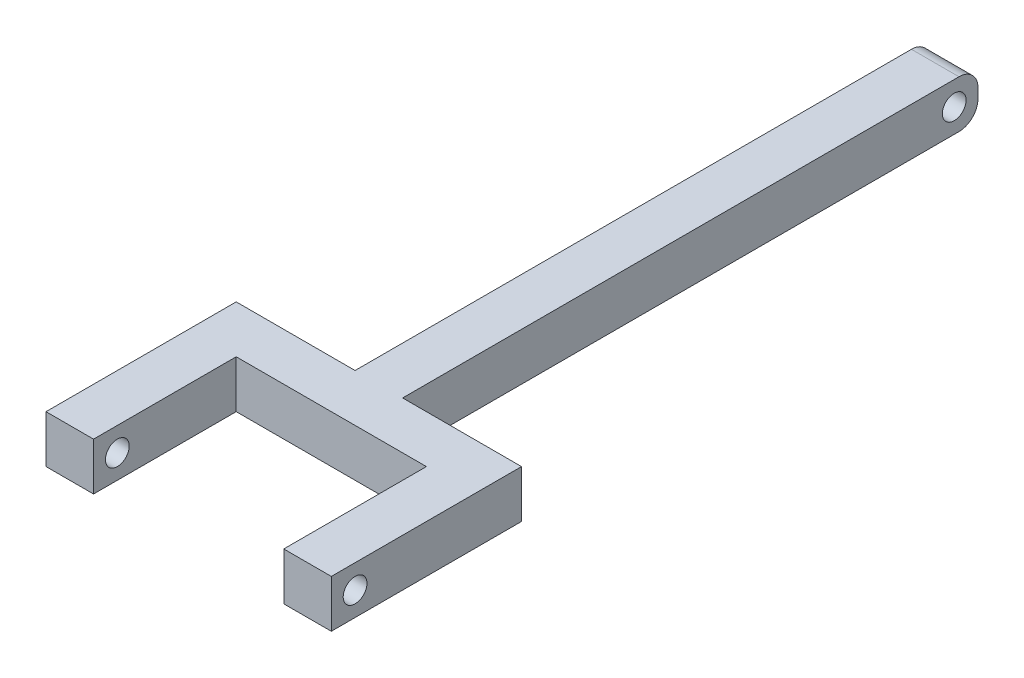
ISO-10303-21;
HEADER;
FILE_DESCRIPTION(('STEP AP214'),'2;1');
FILE_NAME('part.step','',(''),(''),'','','');
FILE_SCHEMA(('AUTOMOTIVE_DESIGN { 1 0 10303 214 1 1 1 1 }'));
ENDSEC;
DATA;
#1=APPLICATION_CONTEXT('core data for automotive mechanical design processes');
#2=APPLICATION_PROTOCOL_DEFINITION('international standard','automotive_design',2000,#1);
#3=PRODUCT_CONTEXT('',#1,'mechanical');
#4=PRODUCT('Part','Part','',(#3));
#5=PRODUCT_RELATED_PRODUCT_CATEGORY('part','',(#4));
#6=PRODUCT_DEFINITION_FORMATION('','',#4);
#7=PRODUCT_DEFINITION_CONTEXT('part definition',#1,'design');
#8=PRODUCT_DEFINITION('design','',#6,#7);
#9=PRODUCT_DEFINITION_SHAPE('','',#8);
#10=(LENGTH_UNIT() NAMED_UNIT(*) SI_UNIT(.MILLI.,.METRE.));
#11=(NAMED_UNIT(*) PLANE_ANGLE_UNIT() SI_UNIT($,.RADIAN.));
#12=(NAMED_UNIT(*) SI_UNIT($,.STERADIAN.) SOLID_ANGLE_UNIT());
#13=UNCERTAINTY_MEASURE_WITH_UNIT(LENGTH_MEASURE(1.E-05),#10,'distance_accuracy_value','');
#14=(GEOMETRIC_REPRESENTATION_CONTEXT(3) GLOBAL_UNCERTAINTY_ASSIGNED_CONTEXT((#13)) GLOBAL_UNIT_ASSIGNED_CONTEXT((#10,
#11,#12)) REPRESENTATION_CONTEXT('',''));
#15=CARTESIAN_POINT('',(0.,0.,0.));
#16=DIRECTION('',(0.,0.,1.));
#17=DIRECTION('',(1.,0.,0.));
#18=AXIS2_PLACEMENT_3D('',#15,#16,#17);
#19=CARTESIAN_POINT('',(-38.1,0.,0.));
#20=DIRECTION('',(1.,0.,0.));
#21=DIRECTION('',(0.,0.,-1.));
#22=AXIS2_PLACEMENT_3D('',#19,#20,#21);
#23=PLANE('',#22);
#24=DIRECTION('',(0.,0.,1.));
#25=VECTOR('',#24,1.);
#26=CARTESIAN_POINT('',(-38.1,6.35,73.66));
#27=LINE('',#26,#25);
#28=CARTESIAN_POINT('',(-38.1,6.35,73.66));
#29=VERTEX_POINT('',#28);
#30=CARTESIAN_POINT('',(-38.1,6.35,124.46));
#31=VERTEX_POINT('',#30);
#32=EDGE_CURVE('E136',#29,#31,#27,.T.);
#33=ORIENTED_EDGE('',*,*,#32,.F.);
#34=DIRECTION('',(0.,1.,0.));
#35=VECTOR('',#34,1.);
#36=CARTESIAN_POINT('',(-38.1,-6.35,73.66));
#37=LINE('',#36,#35);
#38=CARTESIAN_POINT('',(-38.1,-6.35,73.66));
#39=VERTEX_POINT('',#38);
#40=EDGE_CURVE('E209',#39,#29,#37,.T.);
#41=ORIENTED_EDGE('',*,*,#40,.F.);
#42=DIRECTION('',(0.,0.,-1.));
#43=VECTOR('',#42,1.);
#44=CARTESIAN_POINT('',(-38.1,-6.35,86.36));
#45=LINE('',#44,#43);
#46=CARTESIAN_POINT('',(-38.1,-6.35,124.46));
#47=VERTEX_POINT('',#46);
#48=EDGE_CURVE('E149',#47,#39,#45,.T.);
#49=ORIENTED_EDGE('',*,*,#48,.F.);
#50=DIRECTION('',(0.,-1.,0.));
#51=VECTOR('',#50,1.);
#52=CARTESIAN_POINT('',(-38.1,-6.35,124.46));
#53=LINE('',#52,#51);
#54=EDGE_CURVE('E155',#31,#47,#53,.T.);
#55=ORIENTED_EDGE('',*,*,#54,.F.);
#56=EDGE_LOOP('',(#33,#41,#49,#55));
#57=FACE_BOUND('',#56,.T.);
#58=CARTESIAN_POINT('',(-38.1,0.,118.11));
#59=DIRECTION('',(1.,0.,0.));
#60=DIRECTION('',(0.,0.,-1.));
#61=AXIS2_PLACEMENT_3D('',#58,#59,#60);
#62=CIRCLE('',#61,3.175);
#63=CARTESIAN_POINT('',(-38.1,0.,114.935));
#64=VERTEX_POINT('',#63);
#65=EDGE_CURVE('E163',#64,#64,#62,.F.);
#66=ORIENTED_EDGE('',*,*,#65,.F.);
#67=EDGE_LOOP('',(#66));
#68=FACE_BOUND('',#67,.T.);
#69=ADVANCED_FACE('F33',(#57,#68),#23,.F.);
#70=CARTESIAN_POINT('',(-25.4,-6.35,124.46));
#71=DIRECTION('',(-1.,0.,0.));
#72=DIRECTION('',(0.,0.,1.));
#73=AXIS2_PLACEMENT_3D('',#70,#71,#72);
#74=PLANE('',#73);
#75=DIRECTION('',(0.,0.,-1.));
#76=VECTOR('',#75,1.);
#77=CARTESIAN_POINT('',(-25.4,-6.35,124.46));
#78=LINE('',#77,#76);
#79=CARTESIAN_POINT('',(-25.4,-6.35,124.46));
#80=VERTEX_POINT('',#79);
#81=CARTESIAN_POINT('',(-25.4,-6.35,86.36));
#82=VERTEX_POINT('',#81);
#83=EDGE_CURVE('E174',#80,#82,#78,.T.);
#84=ORIENTED_EDGE('',*,*,#83,.T.);
#85=DIRECTION('',(0.,1.,0.));
#86=VECTOR('',#85,1.);
#87=CARTESIAN_POINT('',(-25.4,0.,86.36));
#88=LINE('',#87,#86);
#89=CARTESIAN_POINT('',(-25.4,6.35,86.36));
#90=VERTEX_POINT('',#89);
#91=EDGE_CURVE('E177',#82,#90,#88,.T.);
#92=ORIENTED_EDGE('',*,*,#91,.T.);
#93=DIRECTION('',(0.,0.,-1.));
#94=VECTOR('',#93,1.);
#95=CARTESIAN_POINT('',(-25.4,6.35,124.46));
#96=LINE('',#95,#94);
#97=CARTESIAN_POINT('',(-25.4,6.35,124.46));
#98=VERTEX_POINT('',#97);
#99=EDGE_CURVE('E173',#98,#90,#96,.T.);
#100=ORIENTED_EDGE('',*,*,#99,.F.);
#101=DIRECTION('',(0.,1.,0.));
#102=VECTOR('',#101,1.);
#103=CARTESIAN_POINT('',(-25.4,-6.35,124.46));
#104=LINE('',#103,#102);
#105=EDGE_CURVE('E157',#80,#98,#104,.T.);
#106=ORIENTED_EDGE('',*,*,#105,.F.);
#107=EDGE_LOOP('',(#84,#92,#100,#106));
#108=FACE_BOUND('',#107,.T.);
#109=CARTESIAN_POINT('',(-25.4,0.,118.11));
#110=DIRECTION('',(-1.,0.,0.));
#111=DIRECTION('',(0.,0.,1.));
#112=AXIS2_PLACEMENT_3D('',#109,#110,#111);
#113=CIRCLE('',#112,3.175);
#114=CARTESIAN_POINT('',(-25.4,0.,121.285));
#115=VERTEX_POINT('',#114);
#116=EDGE_CURVE('E166',#115,#115,#113,.T.);
#117=ORIENTED_EDGE('',*,*,#116,.T.);
#118=EDGE_LOOP('',(#117));
#119=FACE_BOUND('',#118,.T.);
#120=ADVANCED_FACE('F304',(#108,#119),#74,.F.);
#121=CARTESIAN_POINT('',(0.,0.,86.36));
#122=DIRECTION('',(0.,0.,-1.));
#123=DIRECTION('',(-1.,0.,0.));
#124=AXIS2_PLACEMENT_3D('',#121,#122,#123);
#125=PLANE('',#124);
#126=ORIENTED_EDGE('',*,*,#91,.F.);
#127=DIRECTION('',(1.,0.,0.));
#128=VECTOR('',#127,1.);
#129=CARTESIAN_POINT('',(-6.35,-6.35,86.36));
#130=LINE('',#129,#128);
#131=CARTESIAN_POINT('',(25.4,-6.35,86.36));
#132=VERTEX_POINT('',#131);
#133=EDGE_CURVE('E231',#82,#132,#130,.T.);
#134=ORIENTED_EDGE('',*,*,#133,.T.);
#135=DIRECTION('',(0.,1.,0.));
#136=VECTOR('',#135,1.);
#137=CARTESIAN_POINT('',(25.4,0.,86.36));
#138=LINE('',#137,#136);
#139=CARTESIAN_POINT('',(25.4,6.35,86.36));
#140=VERTEX_POINT('',#139);
#141=EDGE_CURVE('E150',#132,#140,#138,.T.);
#142=ORIENTED_EDGE('',*,*,#141,.T.);
#143=DIRECTION('',(-1.,0.,0.));
#144=VECTOR('',#143,1.);
#145=CARTESIAN_POINT('',(-6.35,6.35,86.36));
#146=LINE('',#145,#144);
#147=EDGE_CURVE('E233',#140,#90,#146,.T.);
#148=ORIENTED_EDGE('',*,*,#147,.T.);
#149=EDGE_LOOP('',(#126,#134,#142,#148));
#150=FACE_BOUND('',#149,.T.);
#151=ADVANCED_FACE('F308',(#150),#125,.F.);
#152=CARTESIAN_POINT('',(-6.35,-6.35,86.36));
#153=DIRECTION('',(1.,0.,0.));
#154=DIRECTION('',(0.,0.,-1.));
#155=AXIS2_PLACEMENT_3D('',#152,#153,#154);
#156=PLANE('',#155);
#157=CARTESIAN_POINT('',(-6.35,0.,-73.66));
#158=DIRECTION('',(-1.,0.,0.));
#159=DIRECTION('',(0.,0.,1.));
#160=AXIS2_PLACEMENT_3D('',#157,#158,#159);
#161=CIRCLE('',#160,3.175);
#162=CARTESIAN_POINT('',(-6.35,0.,-70.485));
#163=VERTEX_POINT('',#162);
#164=EDGE_CURVE('E250',#163,#163,#161,.T.);
#165=ORIENTED_EDGE('',*,*,#164,.F.);
#166=EDGE_LOOP('',(#165));
#167=FACE_BOUND('',#166,.T.);
#168=DIRECTION('',(0.,-1.,0.));
#169=VECTOR('',#168,1.);
#170=CARTESIAN_POINT('',(-6.35,-6.35,-80.01));
#171=LINE('',#170,#169);
#172=CARTESIAN_POINT('',(-6.35,1.27,-80.01));
#173=VERTEX_POINT('',#172);
#174=CARTESIAN_POINT('',(-6.35,-1.27,-80.01));
#175=VERTEX_POINT('',#174);
#176=EDGE_CURVE('E226',#173,#175,#171,.T.);
#177=ORIENTED_EDGE('',*,*,#176,.T.);
#178=CARTESIAN_POINT('',(-6.35,-1.27,-74.93));
#179=DIRECTION('',(1.,0.,0.));
#180=DIRECTION('',(0.,0.,-1.));
#181=AXIS2_PLACEMENT_3D('',#178,#179,#180);
#182=CIRCLE('',#181,5.08);
#183=CARTESIAN_POINT('',(-6.35,-6.35,-74.93));
#184=VERTEX_POINT('',#183);
#185=EDGE_CURVE('E41',#175,#184,#182,.F.);
#186=ORIENTED_EDGE('',*,*,#185,.T.);
#187=DIRECTION('',(0.,0.,-1.));
#188=VECTOR('',#187,1.);
#189=CARTESIAN_POINT('',(-6.35,-6.35,86.36));
#190=LINE('',#189,#188);
#191=CARTESIAN_POINT('',(-6.34999999999999,-6.35,73.66));
#192=VERTEX_POINT('',#191);
#193=EDGE_CURVE('E243',#192,#184,#190,.T.);
#194=ORIENTED_EDGE('',*,*,#193,.F.);
#195=DIRECTION('',(0.,-1.,0.));
#196=VECTOR('',#195,1.);
#197=CARTESIAN_POINT('',(-6.35,-6.35,73.66));
#198=LINE('',#197,#196);
#199=CARTESIAN_POINT('',(-6.35,6.35,73.66));
#200=VERTEX_POINT('',#199);
#201=EDGE_CURVE('E223',#200,#192,#198,.T.);
#202=ORIENTED_EDGE('',*,*,#201,.F.);
#203=DIRECTION('',(0.,0.,-1.));
#204=VECTOR('',#203,1.);
#205=CARTESIAN_POINT('',(-6.35,6.35,86.36));
#206=LINE('',#205,#204);
#207=CARTESIAN_POINT('',(-6.35,6.35,-74.93));
#208=VERTEX_POINT('',#207);
#209=EDGE_CURVE('E235',#200,#208,#206,.T.);
#210=ORIENTED_EDGE('',*,*,#209,.T.);
#211=CARTESIAN_POINT('',(-6.35,1.27,-74.93));
#212=DIRECTION('',(1.,0.,0.));
#213=DIRECTION('',(0.,0.,-1.));
#214=AXIS2_PLACEMENT_3D('',#211,#212,#213);
#215=CIRCLE('',#214,5.08);
#216=EDGE_CURVE('E48',#208,#173,#215,.F.);
#217=ORIENTED_EDGE('',*,*,#216,.T.);
#218=EDGE_LOOP('',(#177,#186,#194,#202,#210,#217));
#219=FACE_BOUND('',#218,.T.);
#220=ADVANCED_FACE('F262',(#167,#219),#156,.F.);
#221=CARTESIAN_POINT('',(6.35,-6.35,86.36));
#222=DIRECTION('',(-1.,0.,0.));
#223=DIRECTION('',(0.,0.,1.));
#224=AXIS2_PLACEMENT_3D('',#221,#222,#223);
#225=PLANE('',#224);
#226=CARTESIAN_POINT('',(6.35,0.,-73.66));
#227=DIRECTION('',(-1.,0.,0.));
#228=DIRECTION('',(0.,0.,1.));
#229=AXIS2_PLACEMENT_3D('',#226,#227,#228);
#230=CIRCLE('',#229,3.175);
#231=CARTESIAN_POINT('',(6.35,0.,-70.485));
#232=VERTEX_POINT('',#231);
#233=EDGE_CURVE('E247',#232,#232,#230,.T.);
#234=ORIENTED_EDGE('',*,*,#233,.T.);
#235=EDGE_LOOP('',(#234));
#236=FACE_BOUND('',#235,.T.);
#237=DIRECTION('',(0.,0.,-1.));
#238=VECTOR('',#237,1.);
#239=CARTESIAN_POINT('',(6.35,-6.35,86.36));
#240=LINE('',#239,#238);
#241=CARTESIAN_POINT('',(6.35,-6.35,73.66));
#242=VERTEX_POINT('',#241);
#243=CARTESIAN_POINT('',(6.35,-6.35,-74.93));
#244=VERTEX_POINT('',#243);
#245=EDGE_CURVE('E240',#242,#244,#240,.T.);
#246=ORIENTED_EDGE('',*,*,#245,.T.);
#247=CARTESIAN_POINT('',(6.35,-1.27,-74.93));
#248=DIRECTION('',(-1.,0.,0.));
#249=DIRECTION('',(0.,0.,1.));
#250=AXIS2_PLACEMENT_3D('',#247,#248,#249);
#251=CIRCLE('',#250,5.08);
#252=CARTESIAN_POINT('',(6.35,-1.27,-80.01));
#253=VERTEX_POINT('',#252);
#254=EDGE_CURVE('E255',#244,#253,#251,.F.);
#255=ORIENTED_EDGE('',*,*,#254,.T.);
#256=DIRECTION('',(0.,1.,0.));
#257=VECTOR('',#256,1.);
#258=CARTESIAN_POINT('',(6.35,-6.35,-80.01));
#259=LINE('',#258,#257);
#260=CARTESIAN_POINT('',(6.35,1.27,-80.01));
#261=VERTEX_POINT('',#260);
#262=EDGE_CURVE('E228',#253,#261,#259,.T.);
#263=ORIENTED_EDGE('',*,*,#262,.T.);
#264=CARTESIAN_POINT('',(6.35,1.27,-74.93));
#265=DIRECTION('',(-1.,0.,0.));
#266=DIRECTION('',(0.,0.,1.));
#267=AXIS2_PLACEMENT_3D('',#264,#265,#266);
#268=CIRCLE('',#267,5.08);
#269=CARTESIAN_POINT('',(6.35,6.35,-74.93));
#270=VERTEX_POINT('',#269);
#271=EDGE_CURVE('E253',#261,#270,#268,.F.);
#272=ORIENTED_EDGE('',*,*,#271,.T.);
#273=DIRECTION('',(0.,0.,-1.));
#274=VECTOR('',#273,1.);
#275=CARTESIAN_POINT('',(6.35,6.35,86.36));
#276=LINE('',#275,#274);
#277=CARTESIAN_POINT('',(6.35000000000002,6.35,73.66));
#278=VERTEX_POINT('',#277);
#279=EDGE_CURVE('E238',#278,#270,#276,.T.);
#280=ORIENTED_EDGE('',*,*,#279,.F.);
#281=DIRECTION('',(0.,1.,0.));
#282=VECTOR('',#281,1.);
#283=CARTESIAN_POINT('',(6.35,-6.35,73.66));
#284=LINE('',#283,#282);
#285=EDGE_CURVE('E220',#242,#278,#284,.T.);
#286=ORIENTED_EDGE('',*,*,#285,.F.);
#287=EDGE_LOOP('',(#246,#255,#263,#272,#280,#286));
#288=FACE_BOUND('',#287,.T.);
#289=ADVANCED_FACE('F271',(#236,#288),#225,.F.);
#290=CARTESIAN_POINT('',(-6.35,-6.35,86.36));
#291=DIRECTION('',(0.,1.,0.));
#292=DIRECTION('',(0.,0.,1.));
#293=AXIS2_PLACEMENT_3D('',#290,#291,#292);
#294=PLANE('',#293);
#295=ORIENTED_EDGE('',*,*,#193,.T.);
#296=DIRECTION('',(1.,0.,0.));
#297=VECTOR('',#296,1.);
#298=CARTESIAN_POINT('',(6.35,-6.35,-74.93));
#299=LINE('',#298,#297);
#300=EDGE_CURVE('E246',#184,#244,#299,.T.);
#301=ORIENTED_EDGE('',*,*,#300,.T.);
#302=ORIENTED_EDGE('',*,*,#245,.F.);
#303=DIRECTION('',(-1.,0.,0.));
#304=VECTOR('',#303,1.);
#305=CARTESIAN_POINT('',(38.1,-6.35,73.66));
#306=LINE('',#305,#304);
#307=CARTESIAN_POINT('',(38.1,-6.35,73.66));
#308=VERTEX_POINT('',#307);
#309=EDGE_CURVE('E218',#308,#242,#306,.T.);
#310=ORIENTED_EDGE('',*,*,#309,.F.);
#311=DIRECTION('',(0.,0.,-1.));
#312=VECTOR('',#311,1.);
#313=CARTESIAN_POINT('',(38.1,-6.35,86.36));
#314=LINE('',#313,#312);
#315=CARTESIAN_POINT('',(38.1,-6.35,124.46));
#316=VERTEX_POINT('',#315);
#317=EDGE_CURVE('E208',#316,#308,#314,.T.);
#318=ORIENTED_EDGE('',*,*,#317,.F.);
#319=DIRECTION('',(-1.,0.,0.));
#320=VECTOR('',#319,1.);
#321=CARTESIAN_POINT('',(38.1,-6.35,124.46));
#322=LINE('',#321,#320);
#323=CARTESIAN_POINT('',(25.4,-6.35,124.46));
#324=VERTEX_POINT('',#323);
#325=EDGE_CURVE('E190',#316,#324,#322,.T.);
#326=ORIENTED_EDGE('',*,*,#325,.T.);
#327=DIRECTION('',(0.,0.,-1.));
#328=VECTOR('',#327,1.);
#329=CARTESIAN_POINT('',(25.4,-6.35,124.46));
#330=LINE('',#329,#328);
#331=EDGE_CURVE('E199',#324,#132,#330,.T.);
#332=ORIENTED_EDGE('',*,*,#331,.T.);
#333=ORIENTED_EDGE('',*,*,#133,.F.);
#334=ORIENTED_EDGE('',*,*,#83,.F.);
#335=DIRECTION('',(1.,0.,0.));
#336=VECTOR('',#335,1.);
#337=CARTESIAN_POINT('',(-38.1,-6.35,124.46));
#338=LINE('',#337,#336);
#339=EDGE_CURVE('E171',#47,#80,#338,.T.);
#340=ORIENTED_EDGE('',*,*,#339,.F.);
#341=ORIENTED_EDGE('',*,*,#48,.T.);
#342=EDGE_CURVE('E217',#192,#39,#306,.T.);
#343=ORIENTED_EDGE('',*,*,#342,.F.);
#344=EDGE_LOOP('',(#295,#301,#302,#310,#318,#326,#332,#333,#334,#340,#341,#343));
#345=FACE_BOUND('',#344,.T.);
#346=ADVANCED_FACE('F267',(#345),#294,.F.);
#347=CARTESIAN_POINT('',(-6.35,6.35,86.36));
#348=DIRECTION('',(0.,-1.,0.));
#349=DIRECTION('',(0.,0.,-1.));
#350=AXIS2_PLACEMENT_3D('',#347,#348,#349);
#351=PLANE('',#350);
#352=ORIENTED_EDGE('',*,*,#279,.T.);
#353=DIRECTION('',(-1.,0.,0.));
#354=VECTOR('',#353,1.);
#355=CARTESIAN_POINT('',(-6.35,6.35,-74.93));
#356=LINE('',#355,#354);
#357=EDGE_CURVE('E11',#270,#208,#356,.T.);
#358=ORIENTED_EDGE('',*,*,#357,.T.);
#359=ORIENTED_EDGE('',*,*,#209,.F.);
#360=DIRECTION('',(-1.,0.,0.));
#361=VECTOR('',#360,1.);
#362=CARTESIAN_POINT('',(38.1,6.35,73.66));
#363=LINE('',#362,#361);
#364=EDGE_CURVE('E144',#200,#29,#363,.T.);
#365=ORIENTED_EDGE('',*,*,#364,.T.);
#366=ORIENTED_EDGE('',*,*,#32,.T.);
#367=DIRECTION('',(-1.,0.,0.));
#368=VECTOR('',#367,1.);
#369=CARTESIAN_POINT('',(-38.1,6.35,124.46));
#370=LINE('',#369,#368);
#371=EDGE_CURVE('E141',#98,#31,#370,.T.);
#372=ORIENTED_EDGE('',*,*,#371,.F.);
#373=ORIENTED_EDGE('',*,*,#99,.T.);
#374=ORIENTED_EDGE('',*,*,#147,.F.);
#375=DIRECTION('',(0.,0.,-1.));
#376=VECTOR('',#375,1.);
#377=CARTESIAN_POINT('',(25.4,6.35,124.46));
#378=LINE('',#377,#376);
#379=CARTESIAN_POINT('',(25.4,6.35,124.46));
#380=VERTEX_POINT('',#379);
#381=EDGE_CURVE('E200',#380,#140,#378,.T.);
#382=ORIENTED_EDGE('',*,*,#381,.F.);
#383=DIRECTION('',(1.,0.,0.));
#384=VECTOR('',#383,1.);
#385=CARTESIAN_POINT('',(38.1,6.35,124.46));
#386=LINE('',#385,#384);
#387=CARTESIAN_POINT('',(38.1,6.35,124.46));
#388=VERTEX_POINT('',#387);
#389=EDGE_CURVE('E196',#380,#388,#386,.T.);
#390=ORIENTED_EDGE('',*,*,#389,.T.);
#391=DIRECTION('',(0.,0.,1.));
#392=VECTOR('',#391,1.);
#393=CARTESIAN_POINT('',(38.1,6.35,73.66));
#394=LINE('',#393,#392);
#395=CARTESIAN_POINT('',(38.1,6.35,73.66));
#396=VERTEX_POINT('',#395);
#397=EDGE_CURVE('E206',#396,#388,#394,.T.);
#398=ORIENTED_EDGE('',*,*,#397,.F.);
#399=EDGE_CURVE('E215',#396,#278,#363,.T.);
#400=ORIENTED_EDGE('',*,*,#399,.T.);
#401=EDGE_LOOP('',(#352,#358,#359,#365,#366,#372,#373,#374,#382,#390,#398,#400));
#402=FACE_BOUND('',#401,.T.);
#403=ADVANCED_FACE('F139',(#402),#351,.F.);
#404=CARTESIAN_POINT('',(0.,0.,-80.01));
#405=DIRECTION('',(0.,0.,-1.));
#406=DIRECTION('',(-1.,0.,0.));
#407=AXIS2_PLACEMENT_3D('',#404,#405,#406);
#408=PLANE('',#407);
#409=ORIENTED_EDGE('',*,*,#262,.F.);
#410=DIRECTION('',(1.,0.,0.));
#411=VECTOR('',#410,1.);
#412=CARTESIAN_POINT('',(-6.35,-1.27,-80.01));
#413=LINE('',#412,#411);
#414=EDGE_CURVE('E55',#253,#175,#413,.F.);
#415=ORIENTED_EDGE('',*,*,#414,.T.);
#416=ORIENTED_EDGE('',*,*,#176,.F.);
#417=DIRECTION('',(-1.,0.,0.));
#418=VECTOR('',#417,1.);
#419=CARTESIAN_POINT('',(6.35,1.27,-80.01));
#420=LINE('',#419,#418);
#421=EDGE_CURVE('E257',#173,#261,#420,.F.);
#422=ORIENTED_EDGE('',*,*,#421,.T.);
#423=EDGE_LOOP('',(#409,#415,#416,#422));
#424=FACE_BOUND('',#423,.T.);
#425=ADVANCED_FACE('F274',(#424),#408,.T.);
#426=CARTESIAN_POINT('',(38.1,0.,0.));
#427=DIRECTION('',(1.,0.,0.));
#428=DIRECTION('',(0.,0.,-1.));
#429=AXIS2_PLACEMENT_3D('',#426,#427,#428);
#430=PLANE('',#429);
#431=CARTESIAN_POINT('',(38.1,0.,118.11));
#432=DIRECTION('',(1.,0.,0.));
#433=DIRECTION('',(0.,0.,-1.));
#434=AXIS2_PLACEMENT_3D('',#431,#432,#433);
#435=CIRCLE('',#434,3.175);
#436=CARTESIAN_POINT('',(38.1,0.,114.935));
#437=VERTEX_POINT('',#436);
#438=EDGE_CURVE('E184',#437,#437,#435,.T.);
#439=ORIENTED_EDGE('',*,*,#438,.F.);
#440=EDGE_LOOP('',(#439));
#441=FACE_BOUND('',#440,.T.);
#442=ORIENTED_EDGE('',*,*,#397,.T.);
#443=DIRECTION('',(0.,-1.,0.));
#444=VECTOR('',#443,1.);
#445=CARTESIAN_POINT('',(38.1,-6.35,124.46));
#446=LINE('',#445,#444);
#447=EDGE_CURVE('E187',#388,#316,#446,.T.);
#448=ORIENTED_EDGE('',*,*,#447,.T.);
#449=ORIENTED_EDGE('',*,*,#317,.T.);
#450=DIRECTION('',(0.,1.,0.));
#451=VECTOR('',#450,1.);
#452=CARTESIAN_POINT('',(38.1,-6.35,73.66));
#453=LINE('',#452,#451);
#454=EDGE_CURVE('E211',#308,#396,#453,.T.);
#455=ORIENTED_EDGE('',*,*,#454,.T.);
#456=EDGE_LOOP('',(#442,#448,#449,#455));
#457=FACE_BOUND('',#456,.T.);
#458=ADVANCED_FACE('F289',(#441,#457),#430,.T.);
#459=CARTESIAN_POINT('',(38.1,-6.35,73.66));
#460=DIRECTION('',(0.,0.,1.));
#461=DIRECTION('',(1.,0.,0.));
#462=AXIS2_PLACEMENT_3D('',#459,#460,#461);
#463=PLANE('',#462);
#464=ORIENTED_EDGE('',*,*,#285,.T.);
#465=ORIENTED_EDGE('',*,*,#399,.F.);
#466=ORIENTED_EDGE('',*,*,#454,.F.);
#467=ORIENTED_EDGE('',*,*,#309,.T.);
#468=EDGE_LOOP('',(#464,#465,#466,#467));
#469=FACE_BOUND('',#468,.T.);
#470=ADVANCED_FACE('F280',(#469),#463,.F.);
#471=ORIENTED_EDGE('',*,*,#40,.T.);
#472=ORIENTED_EDGE('',*,*,#364,.F.);
#473=ORIENTED_EDGE('',*,*,#201,.T.);
#474=ORIENTED_EDGE('',*,*,#342,.T.);
#475=EDGE_LOOP('',(#471,#472,#473,#474));
#476=FACE_BOUND('',#475,.T.);
#477=ADVANCED_FACE('F297',(#476),#463,.F.);
#478=CARTESIAN_POINT('',(25.4,-6.35,124.46));
#479=DIRECTION('',(-1.,0.,0.));
#480=DIRECTION('',(0.,0.,1.));
#481=AXIS2_PLACEMENT_3D('',#478,#479,#480);
#482=PLANE('',#481);
#483=CARTESIAN_POINT('',(25.4,0.,118.11));
#484=DIRECTION('',(-1.,0.,0.));
#485=DIRECTION('',(0.,0.,1.));
#486=AXIS2_PLACEMENT_3D('',#483,#484,#485);
#487=CIRCLE('',#486,3.175);
#488=CARTESIAN_POINT('',(25.4,0.,121.285));
#489=VERTEX_POINT('',#488);
#490=EDGE_CURVE('E181',#489,#489,#487,.T.);
#491=ORIENTED_EDGE('',*,*,#490,.F.);
#492=EDGE_LOOP('',(#491));
#493=FACE_BOUND('',#492,.T.);
#494=ORIENTED_EDGE('',*,*,#141,.F.);
#495=ORIENTED_EDGE('',*,*,#331,.F.);
#496=DIRECTION('',(0.,1.,0.));
#497=VECTOR('',#496,1.);
#498=CARTESIAN_POINT('',(25.4,-6.35,124.46));
#499=LINE('',#498,#497);
#500=EDGE_CURVE('E193',#324,#380,#499,.T.);
#501=ORIENTED_EDGE('',*,*,#500,.T.);
#502=ORIENTED_EDGE('',*,*,#381,.T.);
#503=EDGE_LOOP('',(#494,#495,#501,#502));
#504=FACE_BOUND('',#503,.T.);
#505=ADVANCED_FACE('F312',(#493,#504),#482,.T.);
#506=CARTESIAN_POINT('',(0.,0.,124.46));
#507=DIRECTION('',(0.,0.,1.));
#508=DIRECTION('',(1.,0.,0.));
#509=AXIS2_PLACEMENT_3D('',#506,#507,#508);
#510=PLANE('',#509);
#511=ORIENTED_EDGE('',*,*,#447,.F.);
#512=ORIENTED_EDGE('',*,*,#389,.F.);
#513=ORIENTED_EDGE('',*,*,#500,.F.);
#514=ORIENTED_EDGE('',*,*,#325,.F.);
#515=EDGE_LOOP('',(#511,#512,#513,#514));
#516=FACE_BOUND('',#515,.T.);
#517=ADVANCED_FACE('F287',(#516),#510,.T.);
#518=CARTESIAN_POINT('',(41.91,0.,118.11));
#519=DIRECTION('',(-1.,0.,0.));
#520=DIRECTION('',(0.,0.,1.));
#521=AXIS2_PLACEMENT_3D('',#518,#519,#520);
#522=CYLINDRICAL_SURFACE('',#521,3.175);
#523=ORIENTED_EDGE('',*,*,#438,.T.);
#524=EDGE_LOOP('',(#523));
#525=FACE_BOUND('',#524,.T.);
#526=ORIENTED_EDGE('',*,*,#490,.T.);
#527=EDGE_LOOP('',(#526));
#528=FACE_BOUND('',#527,.T.);
#529=ADVANCED_FACE('F345',(#525,#528),#522,.F.);
#530=CARTESIAN_POINT('',(0.,0.,124.46));
#531=DIRECTION('',(0.,0.,1.));
#532=DIRECTION('',(-1.,0.,0.));
#533=AXIS2_PLACEMENT_3D('',#530,#531,#532);
#534=PLANE('',#533);
#535=ORIENTED_EDGE('',*,*,#54,.T.);
#536=ORIENTED_EDGE('',*,*,#339,.T.);
#537=ORIENTED_EDGE('',*,*,#105,.T.);
#538=ORIENTED_EDGE('',*,*,#371,.T.);
#539=EDGE_LOOP('',(#535,#536,#537,#538));
#540=FACE_BOUND('',#539,.T.);
#541=ADVANCED_FACE('F154',(#540),#534,.T.);
#542=CARTESIAN_POINT('',(-41.91,0.,118.11));
#543=DIRECTION('',(1.,0.,0.));
#544=DIRECTION('',(0.,0.,-1.));
#545=AXIS2_PLACEMENT_3D('',#542,#543,#544);
#546=CYLINDRICAL_SURFACE('',#545,3.175);
#547=ORIENTED_EDGE('',*,*,#116,.F.);
#548=EDGE_LOOP('',(#547));
#549=FACE_BOUND('',#548,.T.);
#550=ORIENTED_EDGE('',*,*,#65,.T.);
#551=EDGE_LOOP('',(#550));
#552=FACE_BOUND('',#551,.T.);
#553=ADVANCED_FACE('F333',(#549,#552),#546,.F.);
#554=CARTESIAN_POINT('',(38.1,0.,-73.66));
#555=DIRECTION('',(-1.,0.,0.));
#556=DIRECTION('',(0.,0.,1.));
#557=AXIS2_PLACEMENT_3D('',#554,#555,#556);
#558=CYLINDRICAL_SURFACE('',#557,3.175);
#559=ORIENTED_EDGE('',*,*,#164,.T.);
#560=EDGE_LOOP('',(#559));
#561=FACE_BOUND('',#560,.T.);
#562=ORIENTED_EDGE('',*,*,#233,.F.);
#563=EDGE_LOOP('',(#562));
#564=FACE_BOUND('',#563,.T.);
#565=ADVANCED_FACE('F328',(#561,#564),#558,.F.);
#566=CARTESIAN_POINT('',(-6.35,-1.27,-74.93));
#567=DIRECTION('',(-1.,0.,0.));
#568=DIRECTION('',(0.,0.,1.));
#569=AXIS2_PLACEMENT_3D('',#566,#567,#568);
#570=CYLINDRICAL_SURFACE('',#569,5.08);
#571=ORIENTED_EDGE('',*,*,#185,.F.);
#572=ORIENTED_EDGE('',*,*,#414,.F.);
#573=ORIENTED_EDGE('',*,*,#254,.F.);
#574=ORIENTED_EDGE('',*,*,#300,.F.);
#575=EDGE_LOOP('',(#571,#572,#573,#574));
#576=FACE_BOUND('',#575,.T.);
#577=ADVANCED_FACE('F269',(#576),#570,.T.);
#578=CARTESIAN_POINT('',(-6.35,1.27,-74.93));
#579=DIRECTION('',(1.,0.,0.));
#580=DIRECTION('',(0.,0.,-1.));
#581=AXIS2_PLACEMENT_3D('',#578,#579,#580);
#582=CYLINDRICAL_SURFACE('',#581,5.08);
#583=ORIENTED_EDGE('',*,*,#271,.F.);
#584=ORIENTED_EDGE('',*,*,#421,.F.);
#585=ORIENTED_EDGE('',*,*,#216,.F.);
#586=ORIENTED_EDGE('',*,*,#357,.F.);
#587=EDGE_LOOP('',(#583,#584,#585,#586));
#588=FACE_BOUND('',#587,.T.);
#589=ADVANCED_FACE('F35',(#588),#582,.T.);
#590=CLOSED_SHELL('',(#69,#120,#151,#220,#289,#346,#403,#425,#458,#470,#477,#505,#517,#529,#541,
#553,#565,#577,#589));
#591=MANIFOLD_SOLID_BREP('B2',#590);
#592=ADVANCED_BREP_SHAPE_REPRESENTATION('',(#18,#591),#14);
#593=SHAPE_DEFINITION_REPRESENTATION(#9,#592);
ENDSEC;
END-ISO-10303-21;
